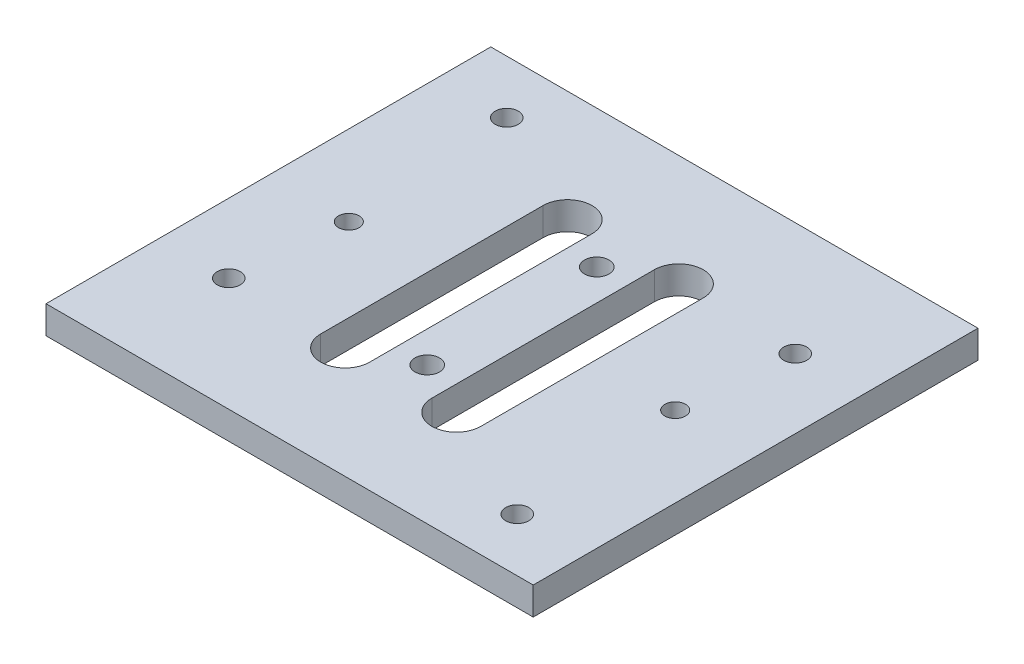
ISO-10303-21;
HEADER;
FILE_DESCRIPTION(('STEP AP214'),'2;1');
FILE_NAME('part.step','',(''),(''),'','','');
FILE_SCHEMA(('AUTOMOTIVE_DESIGN { 1 0 10303 214 1 1 1 1 }'));
ENDSEC;
DATA;
#1=APPLICATION_CONTEXT('core data for automotive mechanical design processes');
#2=APPLICATION_PROTOCOL_DEFINITION('international standard','automotive_design',2000,#1);
#3=PRODUCT_CONTEXT('',#1,'mechanical');
#4=PRODUCT('Part','Part','',(#3));
#5=PRODUCT_RELATED_PRODUCT_CATEGORY('part','',(#4));
#6=PRODUCT_DEFINITION_FORMATION('','',#4);
#7=PRODUCT_DEFINITION_CONTEXT('part definition',#1,'design');
#8=PRODUCT_DEFINITION('design','',#6,#7);
#9=PRODUCT_DEFINITION_SHAPE('','',#8);
#10=(LENGTH_UNIT() NAMED_UNIT(*) SI_UNIT(.MILLI.,.METRE.));
#11=(NAMED_UNIT(*) PLANE_ANGLE_UNIT() SI_UNIT($,.RADIAN.));
#12=(NAMED_UNIT(*) SI_UNIT($,.STERADIAN.) SOLID_ANGLE_UNIT());
#13=UNCERTAINTY_MEASURE_WITH_UNIT(LENGTH_MEASURE(1.E-05),#10,'distance_accuracy_value','');
#14=(GEOMETRIC_REPRESENTATION_CONTEXT(3) GLOBAL_UNCERTAINTY_ASSIGNED_CONTEXT((#13)) GLOBAL_UNIT_ASSIGNED_CONTEXT((#10,
#11,#12)) REPRESENTATION_CONTEXT('',''));
#15=CARTESIAN_POINT('',(0.,0.,0.));
#16=DIRECTION('',(0.,0.,1.));
#17=DIRECTION('',(1.,0.,0.));
#18=AXIS2_PLACEMENT_3D('',#15,#16,#17);
#19=CARTESIAN_POINT('',(0.,5.,0.));
#20=DIRECTION('',(1.,0.,0.));
#21=DIRECTION('',(0.,0.,-1.));
#22=AXIS2_PLACEMENT_3D('',#19,#20,#21);
#23=PLANE('',#22);
#24=DIRECTION('',(0.,0.,1.));
#25=VECTOR('',#24,1.);
#26=CARTESIAN_POINT('',(0.,0.,0.));
#27=LINE('',#26,#25);
#28=CARTESIAN_POINT('',(0.,0.,-80.));
#29=VERTEX_POINT('',#28);
#30=CARTESIAN_POINT('',(0.,0.,0.));
#31=VERTEX_POINT('',#30);
#32=EDGE_CURVE('E233',#29,#31,#27,.T.);
#33=ORIENTED_EDGE('',*,*,#32,.T.);
#34=DIRECTION('',(0.,-1.,0.));
#35=VECTOR('',#34,1.);
#36=CARTESIAN_POINT('',(0.,5.,0.));
#37=LINE('',#36,#35);
#38=CARTESIAN_POINT('',(0.,5.,0.));
#39=VERTEX_POINT('',#38);
#40=EDGE_CURVE('E11',#39,#31,#37,.T.);
#41=ORIENTED_EDGE('',*,*,#40,.F.);
#42=DIRECTION('',(0.,0.,1.));
#43=VECTOR('',#42,1.);
#44=CARTESIAN_POINT('',(0.,5.,0.));
#45=LINE('',#44,#43);
#46=CARTESIAN_POINT('',(0.,5.,-80.));
#47=VERTEX_POINT('',#46);
#48=EDGE_CURVE('E236',#47,#39,#45,.T.);
#49=ORIENTED_EDGE('',*,*,#48,.F.);
#50=DIRECTION('',(0.,-1.,0.));
#51=VECTOR('',#50,1.);
#52=CARTESIAN_POINT('',(0.,5.,-80.));
#53=LINE('',#52,#51);
#54=EDGE_CURVE('E246',#47,#29,#53,.T.);
#55=ORIENTED_EDGE('',*,*,#54,.T.);
#56=EDGE_LOOP('',(#33,#41,#49,#55));
#57=FACE_BOUND('',#56,.T.);
#58=ADVANCED_FACE('F33',(#57),#23,.F.);
#59=CARTESIAN_POINT('',(0.,5.,0.));
#60=DIRECTION('',(0.,0.,-1.));
#61=DIRECTION('',(-1.,0.,0.));
#62=AXIS2_PLACEMENT_3D('',#59,#60,#61);
#63=PLANE('',#62);
#64=DIRECTION('',(1.,0.,0.));
#65=VECTOR('',#64,1.);
#66=CARTESIAN_POINT('',(0.,0.,0.));
#67=LINE('',#66,#65);
#68=CARTESIAN_POINT('',(87.63,0.,0.));
#69=VERTEX_POINT('',#68);
#70=EDGE_CURVE('E249',#31,#69,#67,.T.);
#71=ORIENTED_EDGE('',*,*,#70,.T.);
#72=DIRECTION('',(0.,-1.,0.));
#73=VECTOR('',#72,1.);
#74=CARTESIAN_POINT('',(87.63,5.,0.));
#75=LINE('',#74,#73);
#76=CARTESIAN_POINT('',(87.63,5.,0.));
#77=VERTEX_POINT('',#76);
#78=EDGE_CURVE('E40',#77,#69,#75,.T.);
#79=ORIENTED_EDGE('',*,*,#78,.F.);
#80=DIRECTION('',(1.,0.,0.));
#81=VECTOR('',#80,1.);
#82=CARTESIAN_POINT('',(0.,5.,0.));
#83=LINE('',#82,#81);
#84=EDGE_CURVE('E239',#39,#77,#83,.T.);
#85=ORIENTED_EDGE('',*,*,#84,.F.);
#86=ORIENTED_EDGE('',*,*,#40,.T.);
#87=EDGE_LOOP('',(#71,#79,#85,#86));
#88=FACE_BOUND('',#87,.T.);
#89=ADVANCED_FACE('F278',(#88),#63,.F.);
#90=CARTESIAN_POINT('',(87.63,5.,0.));
#91=DIRECTION('',(-1.,0.,0.));
#92=DIRECTION('',(0.,0.,1.));
#93=AXIS2_PLACEMENT_3D('',#90,#91,#92);
#94=PLANE('',#93);
#95=DIRECTION('',(0.,0.,-1.));
#96=VECTOR('',#95,1.);
#97=CARTESIAN_POINT('',(87.63,0.,0.));
#98=LINE('',#97,#96);
#99=CARTESIAN_POINT('',(87.63,0.,-80.));
#100=VERTEX_POINT('',#99);
#101=EDGE_CURVE('E251',#69,#100,#98,.T.);
#102=ORIENTED_EDGE('',*,*,#101,.T.);
#103=DIRECTION('',(0.,-1.,0.));
#104=VECTOR('',#103,1.);
#105=CARTESIAN_POINT('',(87.63,5.,-80.));
#106=LINE('',#105,#104);
#107=CARTESIAN_POINT('',(87.63,5.,-80.));
#108=VERTEX_POINT('',#107);
#109=EDGE_CURVE('E256',#108,#100,#106,.T.);
#110=ORIENTED_EDGE('',*,*,#109,.F.);
#111=DIRECTION('',(0.,0.,-1.));
#112=VECTOR('',#111,1.);
#113=CARTESIAN_POINT('',(87.63,5.,0.));
#114=LINE('',#113,#112);
#115=EDGE_CURVE('E242',#77,#108,#114,.T.);
#116=ORIENTED_EDGE('',*,*,#115,.F.);
#117=ORIENTED_EDGE('',*,*,#78,.T.);
#118=EDGE_LOOP('',(#102,#110,#116,#117));
#119=FACE_BOUND('',#118,.T.);
#120=ADVANCED_FACE('F263',(#119),#94,.F.);
#121=CARTESIAN_POINT('',(0.,5.,-80.));
#122=DIRECTION('',(0.,0.,1.));
#123=DIRECTION('',(1.,0.,0.));
#124=AXIS2_PLACEMENT_3D('',#121,#122,#123);
#125=PLANE('',#124);
#126=DIRECTION('',(-1.,0.,0.));
#127=VECTOR('',#126,1.);
#128=CARTESIAN_POINT('',(0.,0.,-80.));
#129=LINE('',#128,#127);
#130=EDGE_CURVE('E240',#100,#29,#129,.T.);
#131=ORIENTED_EDGE('',*,*,#130,.T.);
#132=ORIENTED_EDGE('',*,*,#54,.F.);
#133=DIRECTION('',(-1.,0.,0.));
#134=VECTOR('',#133,1.);
#135=CARTESIAN_POINT('',(0.,5.,-80.));
#136=LINE('',#135,#134);
#137=EDGE_CURVE('E244',#108,#47,#136,.T.);
#138=ORIENTED_EDGE('',*,*,#137,.F.);
#139=ORIENTED_EDGE('',*,*,#109,.T.);
#140=EDGE_LOOP('',(#131,#132,#138,#139));
#141=FACE_BOUND('',#140,.T.);
#142=ADVANCED_FACE('F271',(#141),#125,.F.);
#143=CARTESIAN_POINT('',(0.,5.,0.));
#144=DIRECTION('',(0.,-1.,0.));
#145=DIRECTION('',(0.,0.,-1.));
#146=AXIS2_PLACEMENT_3D('',#143,#144,#145);
#147=PLANE('',#146);
#148=DIRECTION('',(0.,0.,1.));
#149=VECTOR('',#148,1.);
#150=CARTESIAN_POINT('',(49.41,5.,-60.));
#151=LINE('',#150,#149);
#152=CARTESIAN_POINT('',(49.41,5.,-60.));
#153=VERTEX_POINT('',#152);
#154=CARTESIAN_POINT('',(49.41,5.,-20.));
#155=VERTEX_POINT('',#154);
#156=EDGE_CURVE('E140',#153,#155,#151,.T.);
#157=ORIENTED_EDGE('',*,*,#156,.F.);
#158=CARTESIAN_POINT('',(53.81,5.,-60.));
#159=DIRECTION('',(0.,1.,0.));
#160=DIRECTION('',(0.,0.,1.));
#161=AXIS2_PLACEMENT_3D('',#158,#159,#160);
#162=CIRCLE('',#161,4.40000000000001);
#163=CARTESIAN_POINT('',(58.21,5.,-60.));
#164=VERTEX_POINT('',#163);
#165=EDGE_CURVE('E47',#164,#153,#162,.T.);
#166=ORIENTED_EDGE('',*,*,#165,.F.);
#167=DIRECTION('',(0.,0.,-1.));
#168=VECTOR('',#167,1.);
#169=CARTESIAN_POINT('',(58.21,5.,-60.));
#170=LINE('',#169,#168);
#171=CARTESIAN_POINT('',(58.21,5.,-20.));
#172=VERTEX_POINT('',#171);
#173=EDGE_CURVE('E133',#172,#164,#170,.T.);
#174=ORIENTED_EDGE('',*,*,#173,.F.);
#175=CARTESIAN_POINT('',(53.81,5.,-20.));
#176=DIRECTION('',(0.,1.,0.));
#177=DIRECTION('',(0.,0.,1.));
#178=AXIS2_PLACEMENT_3D('',#175,#176,#177);
#179=CIRCLE('',#178,4.40000000000001);
#180=EDGE_CURVE('E147',#155,#172,#179,.T.);
#181=ORIENTED_EDGE('',*,*,#180,.F.);
#182=EDGE_LOOP('',(#157,#166,#174,#181));
#183=FACE_BOUND('',#182,.T.);
#184=DIRECTION('',(0.,0.,1.));
#185=VECTOR('',#184,1.);
#186=CARTESIAN_POINT('',(29.41,5.,-60.));
#187=LINE('',#186,#185);
#188=CARTESIAN_POINT('',(29.41,5.,-60.));
#189=VERTEX_POINT('',#188);
#190=CARTESIAN_POINT('',(29.41,5.,-20.));
#191=VERTEX_POINT('',#190);
#192=EDGE_CURVE('E166',#189,#191,#187,.T.);
#193=ORIENTED_EDGE('',*,*,#192,.F.);
#194=CARTESIAN_POINT('',(33.81,5.,-60.));
#195=DIRECTION('',(0.,1.,0.));
#196=DIRECTION('',(0.,0.,1.));
#197=AXIS2_PLACEMENT_3D('',#194,#195,#196);
#198=CIRCLE('',#197,4.4);
#199=CARTESIAN_POINT('',(38.21,5.,-60.));
#200=VERTEX_POINT('',#199);
#201=EDGE_CURVE('E164',#200,#189,#198,.T.);
#202=ORIENTED_EDGE('',*,*,#201,.F.);
#203=DIRECTION('',(0.,0.,-1.));
#204=VECTOR('',#203,1.);
#205=CARTESIAN_POINT('',(38.21,5.,-60.));
#206=LINE('',#205,#204);
#207=CARTESIAN_POINT('',(38.21,5.,-20.));
#208=VERTEX_POINT('',#207);
#209=EDGE_CURVE('E172',#208,#200,#206,.T.);
#210=ORIENTED_EDGE('',*,*,#209,.F.);
#211=CARTESIAN_POINT('',(33.81,5.,-20.));
#212=DIRECTION('',(0.,1.,0.));
#213=DIRECTION('',(0.,0.,1.));
#214=AXIS2_PLACEMENT_3D('',#211,#212,#213);
#215=CIRCLE('',#214,4.4);
#216=EDGE_CURVE('E169',#191,#208,#215,.T.);
#217=ORIENTED_EDGE('',*,*,#216,.F.);
#218=EDGE_LOOP('',(#193,#202,#210,#217));
#219=FACE_BOUND('',#218,.T.);
#220=CARTESIAN_POINT('',(43.82,5.,-24.75));
#221=DIRECTION('',(0.,1.,0.));
#222=DIRECTION('',(0.,0.,1.));
#223=AXIS2_PLACEMENT_3D('',#220,#221,#222);
#224=CIRCLE('',#223,2.2);
#225=CARTESIAN_POINT('',(43.82,5.,-22.55));
#226=VERTEX_POINT('',#225);
#227=EDGE_CURVE('E188',#226,#226,#224,.T.);
#228=ORIENTED_EDGE('',*,*,#227,.F.);
#229=EDGE_LOOP('',(#228));
#230=FACE_BOUND('',#229,.T.);
#231=CARTESIAN_POINT('',(43.81,5.,-55.25));
#232=DIRECTION('',(0.,1.,0.));
#233=DIRECTION('',(0.,0.,1.));
#234=AXIS2_PLACEMENT_3D('',#231,#232,#233);
#235=CIRCLE('',#234,2.20000000000001);
#236=CARTESIAN_POINT('',(43.81,5.,-53.05));
#237=VERTEX_POINT('',#236);
#238=EDGE_CURVE('E194',#237,#237,#235,.T.);
#239=ORIENTED_EDGE('',*,*,#238,.F.);
#240=EDGE_LOOP('',(#239));
#241=FACE_BOUND('',#240,.T.);
#242=CARTESIAN_POINT('',(75.165,5.,-59.6));
#243=DIRECTION('',(0.,1.,0.));
#244=DIRECTION('',(0.,0.,1.));
#245=AXIS2_PLACEMENT_3D('',#242,#243,#244);
#246=CIRCLE('',#245,2.07499999999999);
#247=CARTESIAN_POINT('',(75.165,5.,-57.525));
#248=VERTEX_POINT('',#247);
#249=EDGE_CURVE('E197',#248,#248,#246,.T.);
#250=ORIENTED_EDGE('',*,*,#249,.F.);
#251=EDGE_LOOP('',(#250));
#252=FACE_BOUND('',#251,.T.);
#253=CARTESIAN_POINT('',(75.165,5.,-9.60000000000001));
#254=DIRECTION('',(0.,1.,0.));
#255=DIRECTION('',(0.,0.,1.));
#256=AXIS2_PLACEMENT_3D('',#253,#254,#255);
#257=CIRCLE('',#256,2.07499999999999);
#258=CARTESIAN_POINT('',(75.165,5.,-7.52500000000002));
#259=VERTEX_POINT('',#258);
#260=EDGE_CURVE('E203',#259,#259,#257,.T.);
#261=ORIENTED_EDGE('',*,*,#260,.F.);
#262=EDGE_LOOP('',(#261));
#263=FACE_BOUND('',#262,.T.);
#264=CARTESIAN_POINT('',(73.165,5.,-40.));
#265=DIRECTION('',(0.,1.,0.));
#266=DIRECTION('',(0.,0.,1.));
#267=AXIS2_PLACEMENT_3D('',#264,#265,#266);
#268=CIRCLE('',#267,1.84999999999999);
#269=CARTESIAN_POINT('',(73.165,5.,-38.15));
#270=VERTEX_POINT('',#269);
#271=EDGE_CURVE('E209',#270,#270,#268,.T.);
#272=ORIENTED_EDGE('',*,*,#271,.F.);
#273=EDGE_LOOP('',(#272));
#274=FACE_BOUND('',#273,.T.);
#275=CARTESIAN_POINT('',(14.465,5.,-40.));
#276=DIRECTION('',(0.,1.,0.));
#277=DIRECTION('',(0.,0.,1.));
#278=AXIS2_PLACEMENT_3D('',#275,#276,#277);
#279=CIRCLE('',#278,1.85);
#280=CARTESIAN_POINT('',(14.465,5.,-38.15));
#281=VERTEX_POINT('',#280);
#282=EDGE_CURVE('E215',#281,#281,#279,.T.);
#283=ORIENTED_EDGE('',*,*,#282,.F.);
#284=EDGE_LOOP('',(#283));
#285=FACE_BOUND('',#284,.T.);
#286=CARTESIAN_POINT('',(12.465,5.,-20.4));
#287=DIRECTION('',(0.,1.,0.));
#288=DIRECTION('',(0.,0.,1.));
#289=AXIS2_PLACEMENT_3D('',#286,#287,#288);
#290=CIRCLE('',#289,2.075);
#291=CARTESIAN_POINT('',(12.465,5.,-18.325));
#292=VERTEX_POINT('',#291);
#293=EDGE_CURVE('E221',#292,#292,#290,.T.);
#294=ORIENTED_EDGE('',*,*,#293,.F.);
#295=EDGE_LOOP('',(#294));
#296=FACE_BOUND('',#295,.T.);
#297=CARTESIAN_POINT('',(12.465,5.,-70.4));
#298=DIRECTION('',(0.,1.,0.));
#299=DIRECTION('',(0.,0.,1.));
#300=AXIS2_PLACEMENT_3D('',#297,#298,#299);
#301=CIRCLE('',#300,2.07499999999999);
#302=CARTESIAN_POINT('',(12.465,5.,-68.325));
#303=VERTEX_POINT('',#302);
#304=EDGE_CURVE('E227',#303,#303,#301,.T.);
#305=ORIENTED_EDGE('',*,*,#304,.F.);
#306=EDGE_LOOP('',(#305));
#307=FACE_BOUND('',#306,.T.);
#308=ORIENTED_EDGE('',*,*,#48,.T.);
#309=ORIENTED_EDGE('',*,*,#84,.T.);
#310=ORIENTED_EDGE('',*,*,#115,.T.);
#311=ORIENTED_EDGE('',*,*,#137,.T.);
#312=EDGE_LOOP('',(#308,#309,#310,#311));
#313=FACE_BOUND('',#312,.T.);
#314=ADVANCED_FACE('F277',(#183,#219,#230,#241,#252,#263,#274,#285,#296,#307,#313),#147,.F.);
#315=CARTESIAN_POINT('',(0.,0.,0.));
#316=DIRECTION('',(0.,-1.,0.));
#317=DIRECTION('',(0.,0.,-1.));
#318=AXIS2_PLACEMENT_3D('',#315,#316,#317);
#319=PLANE('',#318);
#320=CARTESIAN_POINT('',(53.81,0.,-60.));
#321=DIRECTION('',(0.,-1.,0.));
#322=DIRECTION('',(0.,0.,-1.));
#323=AXIS2_PLACEMENT_3D('',#320,#321,#322);
#324=CIRCLE('',#323,4.40000000000001);
#325=CARTESIAN_POINT('',(58.21,0.,-60.));
#326=VERTEX_POINT('',#325);
#327=CARTESIAN_POINT('',(49.41,0.,-60.));
#328=VERTEX_POINT('',#327);
#329=EDGE_CURVE('E131',#326,#328,#324,.F.);
#330=ORIENTED_EDGE('',*,*,#329,.T.);
#331=DIRECTION('',(0.,0.,1.));
#332=VECTOR('',#331,1.);
#333=CARTESIAN_POINT('',(49.41,0.,-60.));
#334=LINE('',#333,#332);
#335=CARTESIAN_POINT('',(49.41,0.,-20.));
#336=VERTEX_POINT('',#335);
#337=EDGE_CURVE('E120',#328,#336,#334,.T.);
#338=ORIENTED_EDGE('',*,*,#337,.T.);
#339=CARTESIAN_POINT('',(53.81,0.,-20.));
#340=DIRECTION('',(0.,-1.,0.));
#341=DIRECTION('',(0.,0.,-1.));
#342=AXIS2_PLACEMENT_3D('',#339,#340,#341);
#343=CIRCLE('',#342,4.40000000000001);
#344=CARTESIAN_POINT('',(58.21,0.,-20.));
#345=VERTEX_POINT('',#344);
#346=EDGE_CURVE('E142',#336,#345,#343,.F.);
#347=ORIENTED_EDGE('',*,*,#346,.T.);
#348=DIRECTION('',(0.,0.,-1.));
#349=VECTOR('',#348,1.);
#350=CARTESIAN_POINT('',(58.21,0.,-60.));
#351=LINE('',#350,#349);
#352=EDGE_CURVE('E138',#345,#326,#351,.T.);
#353=ORIENTED_EDGE('',*,*,#352,.T.);
#354=EDGE_LOOP('',(#330,#338,#347,#353));
#355=FACE_BOUND('',#354,.T.);
#356=CARTESIAN_POINT('',(33.81,0.,-60.));
#357=DIRECTION('',(0.,-1.,0.));
#358=DIRECTION('',(0.,0.,-1.));
#359=AXIS2_PLACEMENT_3D('',#356,#357,#358);
#360=CIRCLE('',#359,4.4);
#361=CARTESIAN_POINT('',(38.21,0.,-60.));
#362=VERTEX_POINT('',#361);
#363=CARTESIAN_POINT('',(29.41,0.,-60.));
#364=VERTEX_POINT('',#363);
#365=EDGE_CURVE('E161',#362,#364,#360,.F.);
#366=ORIENTED_EDGE('',*,*,#365,.T.);
#367=DIRECTION('',(0.,0.,1.));
#368=VECTOR('',#367,1.);
#369=CARTESIAN_POINT('',(29.41,0.,-60.));
#370=LINE('',#369,#368);
#371=CARTESIAN_POINT('',(29.41,0.,-20.));
#372=VERTEX_POINT('',#371);
#373=EDGE_CURVE('E178',#364,#372,#370,.T.);
#374=ORIENTED_EDGE('',*,*,#373,.T.);
#375=CARTESIAN_POINT('',(33.81,0.,-20.));
#376=DIRECTION('',(0.,-1.,0.));
#377=DIRECTION('',(0.,0.,-1.));
#378=AXIS2_PLACEMENT_3D('',#375,#376,#377);
#379=CIRCLE('',#378,4.4);
#380=CARTESIAN_POINT('',(38.21,0.,-20.));
#381=VERTEX_POINT('',#380);
#382=EDGE_CURVE('E127',#372,#381,#379,.F.);
#383=ORIENTED_EDGE('',*,*,#382,.T.);
#384=DIRECTION('',(0.,0.,-1.));
#385=VECTOR('',#384,1.);
#386=CARTESIAN_POINT('',(38.21,0.,-60.));
#387=LINE('',#386,#385);
#388=EDGE_CURVE('E158',#381,#362,#387,.T.);
#389=ORIENTED_EDGE('',*,*,#388,.T.);
#390=EDGE_LOOP('',(#366,#374,#383,#389));
#391=FACE_BOUND('',#390,.T.);
#392=CARTESIAN_POINT('',(43.82,0.,-24.75));
#393=DIRECTION('',(0.,-1.,0.));
#394=DIRECTION('',(0.,0.,-1.));
#395=AXIS2_PLACEMENT_3D('',#392,#393,#394);
#396=CIRCLE('',#395,2.2);
#397=CARTESIAN_POINT('',(43.82,0.,-26.95));
#398=VERTEX_POINT('',#397);
#399=EDGE_CURVE('E187',#398,#398,#396,.F.);
#400=ORIENTED_EDGE('',*,*,#399,.T.);
#401=EDGE_LOOP('',(#400));
#402=FACE_BOUND('',#401,.T.);
#403=CARTESIAN_POINT('',(43.81,0.,-55.25));
#404=DIRECTION('',(0.,-1.,0.));
#405=DIRECTION('',(0.,0.,-1.));
#406=AXIS2_PLACEMENT_3D('',#403,#404,#405);
#407=CIRCLE('',#406,2.20000000000001);
#408=CARTESIAN_POINT('',(43.81,0.,-57.45));
#409=VERTEX_POINT('',#408);
#410=EDGE_CURVE('E191',#409,#409,#407,.F.);
#411=ORIENTED_EDGE('',*,*,#410,.T.);
#412=EDGE_LOOP('',(#411));
#413=FACE_BOUND('',#412,.T.);
#414=CARTESIAN_POINT('',(75.165,0.,-59.6));
#415=DIRECTION('',(0.,1.,0.));
#416=DIRECTION('',(0.,0.,1.));
#417=AXIS2_PLACEMENT_3D('',#414,#415,#416);
#418=CIRCLE('',#417,2.07499999999999);
#419=CARTESIAN_POINT('',(75.165,0.,-57.525));
#420=VERTEX_POINT('',#419);
#421=EDGE_CURVE('E200',#420,#420,#418,.T.);
#422=ORIENTED_EDGE('',*,*,#421,.T.);
#423=EDGE_LOOP('',(#422));
#424=FACE_BOUND('',#423,.T.);
#425=CARTESIAN_POINT('',(75.165,0.,-9.60000000000001));
#426=DIRECTION('',(0.,1.,0.));
#427=DIRECTION('',(0.,0.,1.));
#428=AXIS2_PLACEMENT_3D('',#425,#426,#427);
#429=CIRCLE('',#428,2.07499999999999);
#430=CARTESIAN_POINT('',(75.165,0.,-7.52500000000002));
#431=VERTEX_POINT('',#430);
#432=EDGE_CURVE('E206',#431,#431,#429,.T.);
#433=ORIENTED_EDGE('',*,*,#432,.T.);
#434=EDGE_LOOP('',(#433));
#435=FACE_BOUND('',#434,.T.);
#436=CARTESIAN_POINT('',(73.165,0.,-40.));
#437=DIRECTION('',(0.,1.,0.));
#438=DIRECTION('',(0.,0.,1.));
#439=AXIS2_PLACEMENT_3D('',#436,#437,#438);
#440=CIRCLE('',#439,1.84999999999999);
#441=CARTESIAN_POINT('',(73.165,0.,-38.15));
#442=VERTEX_POINT('',#441);
#443=EDGE_CURVE('E212',#442,#442,#440,.T.);
#444=ORIENTED_EDGE('',*,*,#443,.T.);
#445=EDGE_LOOP('',(#444));
#446=FACE_BOUND('',#445,.T.);
#447=CARTESIAN_POINT('',(14.465,0.,-40.));
#448=DIRECTION('',(0.,1.,0.));
#449=DIRECTION('',(0.,0.,1.));
#450=AXIS2_PLACEMENT_3D('',#447,#448,#449);
#451=CIRCLE('',#450,1.85);
#452=CARTESIAN_POINT('',(14.465,0.,-38.15));
#453=VERTEX_POINT('',#452);
#454=EDGE_CURVE('E218',#453,#453,#451,.T.);
#455=ORIENTED_EDGE('',*,*,#454,.T.);
#456=EDGE_LOOP('',(#455));
#457=FACE_BOUND('',#456,.T.);
#458=CARTESIAN_POINT('',(12.465,0.,-20.4));
#459=DIRECTION('',(0.,1.,0.));
#460=DIRECTION('',(0.,0.,1.));
#461=AXIS2_PLACEMENT_3D('',#458,#459,#460);
#462=CIRCLE('',#461,2.075);
#463=CARTESIAN_POINT('',(12.465,0.,-18.325));
#464=VERTEX_POINT('',#463);
#465=EDGE_CURVE('E224',#464,#464,#462,.T.);
#466=ORIENTED_EDGE('',*,*,#465,.T.);
#467=EDGE_LOOP('',(#466));
#468=FACE_BOUND('',#467,.T.);
#469=CARTESIAN_POINT('',(12.465,0.,-70.4));
#470=DIRECTION('',(0.,1.,0.));
#471=DIRECTION('',(0.,0.,1.));
#472=AXIS2_PLACEMENT_3D('',#469,#470,#471);
#473=CIRCLE('',#472,2.07499999999999);
#474=CARTESIAN_POINT('',(12.465,0.,-68.325));
#475=VERTEX_POINT('',#474);
#476=EDGE_CURVE('E230',#475,#475,#473,.T.);
#477=ORIENTED_EDGE('',*,*,#476,.T.);
#478=EDGE_LOOP('',(#477));
#479=FACE_BOUND('',#478,.T.);
#480=ORIENTED_EDGE('',*,*,#32,.F.);
#481=ORIENTED_EDGE('',*,*,#130,.F.);
#482=ORIENTED_EDGE('',*,*,#101,.F.);
#483=ORIENTED_EDGE('',*,*,#70,.F.);
#484=EDGE_LOOP('',(#480,#481,#482,#483));
#485=FACE_BOUND('',#484,.T.);
#486=ADVANCED_FACE('F136',(#355,#391,#402,#413,#424,#435,#446,#457,#468,#479,#485),#319,.T.);
#487=CARTESIAN_POINT('',(12.465,0.,-70.4));
#488=DIRECTION('',(0.,1.,0.));
#489=DIRECTION('',(0.,0.,1.));
#490=AXIS2_PLACEMENT_3D('',#487,#488,#489);
#491=CYLINDRICAL_SURFACE('',#490,2.07499999999999);
#492=ORIENTED_EDGE('',*,*,#476,.F.);
#493=EDGE_LOOP('',(#492));
#494=FACE_BOUND('',#493,.T.);
#495=ORIENTED_EDGE('',*,*,#304,.T.);
#496=EDGE_LOOP('',(#495));
#497=FACE_BOUND('',#496,.T.);
#498=ADVANCED_FACE('F290',(#494,#497),#491,.F.);
#499=CARTESIAN_POINT('',(12.465,0.,-20.4));
#500=DIRECTION('',(0.,1.,0.));
#501=DIRECTION('',(0.,0.,1.));
#502=AXIS2_PLACEMENT_3D('',#499,#500,#501);
#503=CYLINDRICAL_SURFACE('',#502,2.075);
#504=ORIENTED_EDGE('',*,*,#465,.F.);
#505=EDGE_LOOP('',(#504));
#506=FACE_BOUND('',#505,.T.);
#507=ORIENTED_EDGE('',*,*,#293,.T.);
#508=EDGE_LOOP('',(#507));
#509=FACE_BOUND('',#508,.T.);
#510=ADVANCED_FACE('F296',(#506,#509),#503,.F.);
#511=CARTESIAN_POINT('',(14.465,0.,-40.));
#512=DIRECTION('',(0.,1.,0.));
#513=DIRECTION('',(0.,0.,1.));
#514=AXIS2_PLACEMENT_3D('',#511,#512,#513);
#515=CYLINDRICAL_SURFACE('',#514,1.85);
#516=ORIENTED_EDGE('',*,*,#454,.F.);
#517=EDGE_LOOP('',(#516));
#518=FACE_BOUND('',#517,.T.);
#519=ORIENTED_EDGE('',*,*,#282,.T.);
#520=EDGE_LOOP('',(#519));
#521=FACE_BOUND('',#520,.T.);
#522=ADVANCED_FACE('F300',(#518,#521),#515,.F.);
#523=CARTESIAN_POINT('',(73.165,0.,-40.));
#524=DIRECTION('',(0.,1.,0.));
#525=DIRECTION('',(0.,0.,1.));
#526=AXIS2_PLACEMENT_3D('',#523,#524,#525);
#527=CYLINDRICAL_SURFACE('',#526,1.84999999999999);
#528=ORIENTED_EDGE('',*,*,#443,.F.);
#529=EDGE_LOOP('',(#528));
#530=FACE_BOUND('',#529,.T.);
#531=ORIENTED_EDGE('',*,*,#271,.T.);
#532=EDGE_LOOP('',(#531));
#533=FACE_BOUND('',#532,.T.);
#534=ADVANCED_FACE('F304',(#530,#533),#527,.F.);
#535=CARTESIAN_POINT('',(75.165,0.,-9.60000000000001));
#536=DIRECTION('',(0.,1.,0.));
#537=DIRECTION('',(0.,0.,1.));
#538=AXIS2_PLACEMENT_3D('',#535,#536,#537);
#539=CYLINDRICAL_SURFACE('',#538,2.07499999999999);
#540=ORIENTED_EDGE('',*,*,#432,.F.);
#541=EDGE_LOOP('',(#540));
#542=FACE_BOUND('',#541,.T.);
#543=ORIENTED_EDGE('',*,*,#260,.T.);
#544=EDGE_LOOP('',(#543));
#545=FACE_BOUND('',#544,.T.);
#546=ADVANCED_FACE('F308',(#542,#545),#539,.F.);
#547=CARTESIAN_POINT('',(75.165,0.,-59.6));
#548=DIRECTION('',(0.,1.,0.));
#549=DIRECTION('',(0.,0.,1.));
#550=AXIS2_PLACEMENT_3D('',#547,#548,#549);
#551=CYLINDRICAL_SURFACE('',#550,2.07499999999999);
#552=ORIENTED_EDGE('',*,*,#421,.F.);
#553=EDGE_LOOP('',(#552));
#554=FACE_BOUND('',#553,.T.);
#555=ORIENTED_EDGE('',*,*,#249,.T.);
#556=EDGE_LOOP('',(#555));
#557=FACE_BOUND('',#556,.T.);
#558=ADVANCED_FACE('F312',(#554,#557),#551,.F.);
#559=CARTESIAN_POINT('',(43.81,-0.00100000000000013,-55.25));
#560=DIRECTION('',(0.,1.,0.));
#561=DIRECTION('',(0.,0.,1.));
#562=AXIS2_PLACEMENT_3D('',#559,#560,#561);
#563=CYLINDRICAL_SURFACE('',#562,2.20000000000001);
#564=ORIENTED_EDGE('',*,*,#410,.F.);
#565=EDGE_LOOP('',(#564));
#566=FACE_BOUND('',#565,.T.);
#567=ORIENTED_EDGE('',*,*,#238,.T.);
#568=EDGE_LOOP('',(#567));
#569=FACE_BOUND('',#568,.T.);
#570=ADVANCED_FACE('F316',(#566,#569),#563,.F.);
#571=CARTESIAN_POINT('',(43.82,-0.00100000000000013,-24.75));
#572=DIRECTION('',(0.,1.,0.));
#573=DIRECTION('',(0.,0.,1.));
#574=AXIS2_PLACEMENT_3D('',#571,#572,#573);
#575=CYLINDRICAL_SURFACE('',#574,2.2);
#576=ORIENTED_EDGE('',*,*,#399,.F.);
#577=EDGE_LOOP('',(#576));
#578=FACE_BOUND('',#577,.T.);
#579=ORIENTED_EDGE('',*,*,#227,.T.);
#580=EDGE_LOOP('',(#579));
#581=FACE_BOUND('',#580,.T.);
#582=ADVANCED_FACE('F320',(#578,#581),#575,.F.);
#583=CARTESIAN_POINT('',(33.81,-0.00100000000000013,-60.));
#584=DIRECTION('',(0.,1.,0.));
#585=DIRECTION('',(0.,0.,1.));
#586=AXIS2_PLACEMENT_3D('',#583,#584,#585);
#587=CYLINDRICAL_SURFACE('',#586,4.4);
#588=DIRECTION('',(0.,1.,0.));
#589=VECTOR('',#588,1.);
#590=CARTESIAN_POINT('',(38.21,-0.00100000000000013,-60.));
#591=LINE('',#590,#589);
#592=EDGE_CURVE('E176',#362,#200,#591,.T.);
#593=ORIENTED_EDGE('',*,*,#592,.T.);
#594=ORIENTED_EDGE('',*,*,#201,.T.);
#595=DIRECTION('',(0.,1.,0.));
#596=VECTOR('',#595,1.);
#597=CARTESIAN_POINT('',(29.41,-0.00100000000000013,-60.));
#598=LINE('',#597,#596);
#599=EDGE_CURVE('E175',#364,#189,#598,.T.);
#600=ORIENTED_EDGE('',*,*,#599,.F.);
#601=ORIENTED_EDGE('',*,*,#365,.F.);
#602=EDGE_LOOP('',(#593,#594,#600,#601));
#603=FACE_BOUND('',#602,.T.);
#604=ADVANCED_FACE('F324',(#603),#587,.F.);
#605=CARTESIAN_POINT('',(38.21,-0.00100000000000013,-60.));
#606=DIRECTION('',(1.,0.,0.));
#607=DIRECTION('',(0.,0.,-1.));
#608=AXIS2_PLACEMENT_3D('',#605,#606,#607);
#609=PLANE('',#608);
#610=DIRECTION('',(0.,1.,0.));
#611=VECTOR('',#610,1.);
#612=CARTESIAN_POINT('',(38.21,-0.00100000000000013,-20.));
#613=LINE('',#612,#611);
#614=EDGE_CURVE('E179',#381,#208,#613,.T.);
#615=ORIENTED_EDGE('',*,*,#614,.T.);
#616=ORIENTED_EDGE('',*,*,#209,.T.);
#617=ORIENTED_EDGE('',*,*,#592,.F.);
#618=ORIENTED_EDGE('',*,*,#388,.F.);
#619=EDGE_LOOP('',(#615,#616,#617,#618));
#620=FACE_BOUND('',#619,.T.);
#621=ADVANCED_FACE('F328',(#620),#609,.F.);
#622=CARTESIAN_POINT('',(33.81,-0.00100000000000013,-20.));
#623=DIRECTION('',(0.,1.,0.));
#624=DIRECTION('',(0.,0.,1.));
#625=AXIS2_PLACEMENT_3D('',#622,#623,#624);
#626=CYLINDRICAL_SURFACE('',#625,4.4);
#627=DIRECTION('',(0.,1.,0.));
#628=VECTOR('',#627,1.);
#629=CARTESIAN_POINT('',(29.41,-0.00100000000000013,-20.));
#630=LINE('',#629,#628);
#631=EDGE_CURVE('E181',#372,#191,#630,.T.);
#632=ORIENTED_EDGE('',*,*,#631,.T.);
#633=ORIENTED_EDGE('',*,*,#216,.T.);
#634=ORIENTED_EDGE('',*,*,#614,.F.);
#635=ORIENTED_EDGE('',*,*,#382,.F.);
#636=EDGE_LOOP('',(#632,#633,#634,#635));
#637=FACE_BOUND('',#636,.T.);
#638=ADVANCED_FACE('F333',(#637),#626,.F.);
#639=CARTESIAN_POINT('',(29.41,-0.00100000000000013,-60.));
#640=DIRECTION('',(-1.,0.,0.));
#641=DIRECTION('',(0.,0.,1.));
#642=AXIS2_PLACEMENT_3D('',#639,#640,#641);
#643=PLANE('',#642);
#644=ORIENTED_EDGE('',*,*,#599,.T.);
#645=ORIENTED_EDGE('',*,*,#192,.T.);
#646=ORIENTED_EDGE('',*,*,#631,.F.);
#647=ORIENTED_EDGE('',*,*,#373,.F.);
#648=EDGE_LOOP('',(#644,#645,#646,#647));
#649=FACE_BOUND('',#648,.T.);
#650=ADVANCED_FACE('F330',(#649),#643,.F.);
#651=CARTESIAN_POINT('',(53.81,-0.00100000000000013,-60.));
#652=DIRECTION('',(0.,1.,0.));
#653=DIRECTION('',(0.,0.,1.));
#654=AXIS2_PLACEMENT_3D('',#651,#652,#653);
#655=CYLINDRICAL_SURFACE('',#654,4.40000000000001);
#656=DIRECTION('',(0.,1.,0.));
#657=VECTOR('',#656,1.);
#658=CARTESIAN_POINT('',(58.21,-0.00100000000000013,-60.));
#659=LINE('',#658,#657);
#660=EDGE_CURVE('E128',#326,#164,#659,.T.);
#661=ORIENTED_EDGE('',*,*,#660,.T.);
#662=ORIENTED_EDGE('',*,*,#165,.T.);
#663=DIRECTION('',(0.,1.,0.));
#664=VECTOR('',#663,1.);
#665=CARTESIAN_POINT('',(49.41,-0.00100000000000013,-60.));
#666=LINE('',#665,#664);
#667=EDGE_CURVE('E122',#328,#153,#666,.T.);
#668=ORIENTED_EDGE('',*,*,#667,.F.);
#669=ORIENTED_EDGE('',*,*,#329,.F.);
#670=EDGE_LOOP('',(#661,#662,#668,#669));
#671=FACE_BOUND('',#670,.T.);
#672=ADVANCED_FACE('F130',(#671),#655,.F.);
#673=CARTESIAN_POINT('',(58.21,-0.00100000000000013,-60.));
#674=DIRECTION('',(1.,0.,0.));
#675=DIRECTION('',(0.,0.,-1.));
#676=AXIS2_PLACEMENT_3D('',#673,#674,#675);
#677=PLANE('',#676);
#678=DIRECTION('',(0.,1.,0.));
#679=VECTOR('',#678,1.);
#680=CARTESIAN_POINT('',(58.21,-0.00100000000000013,-20.));
#681=LINE('',#680,#679);
#682=EDGE_CURVE('E153',#345,#172,#681,.T.);
#683=ORIENTED_EDGE('',*,*,#682,.T.);
#684=ORIENTED_EDGE('',*,*,#173,.T.);
#685=ORIENTED_EDGE('',*,*,#660,.F.);
#686=ORIENTED_EDGE('',*,*,#352,.F.);
#687=EDGE_LOOP('',(#683,#684,#685,#686));
#688=FACE_BOUND('',#687,.T.);
#689=ADVANCED_FACE('F343',(#688),#677,.F.);
#690=CARTESIAN_POINT('',(53.81,-0.00100000000000013,-20.));
#691=DIRECTION('',(0.,1.,0.));
#692=DIRECTION('',(0.,0.,1.));
#693=AXIS2_PLACEMENT_3D('',#690,#691,#692);
#694=CYLINDRICAL_SURFACE('',#693,4.40000000000001);
#695=DIRECTION('',(0.,1.,0.));
#696=VECTOR('',#695,1.);
#697=CARTESIAN_POINT('',(49.41,-0.00100000000000013,-20.));
#698=LINE('',#697,#696);
#699=EDGE_CURVE('E55',#336,#155,#698,.T.);
#700=ORIENTED_EDGE('',*,*,#699,.T.);
#701=ORIENTED_EDGE('',*,*,#180,.T.);
#702=ORIENTED_EDGE('',*,*,#682,.F.);
#703=ORIENTED_EDGE('',*,*,#346,.F.);
#704=EDGE_LOOP('',(#700,#701,#702,#703));
#705=FACE_BOUND('',#704,.T.);
#706=ADVANCED_FACE('F346',(#705),#694,.F.);
#707=CARTESIAN_POINT('',(49.41,-0.00100000000000013,-60.));
#708=DIRECTION('',(-1.,0.,0.));
#709=DIRECTION('',(0.,0.,1.));
#710=AXIS2_PLACEMENT_3D('',#707,#708,#709);
#711=PLANE('',#710);
#712=ORIENTED_EDGE('',*,*,#667,.T.);
#713=ORIENTED_EDGE('',*,*,#156,.T.);
#714=ORIENTED_EDGE('',*,*,#699,.F.);
#715=ORIENTED_EDGE('',*,*,#337,.F.);
#716=EDGE_LOOP('',(#712,#713,#714,#715));
#717=FACE_BOUND('',#716,.T.);
#718=ADVANCED_FACE('F121',(#717),#711,.F.);
#719=CLOSED_SHELL('',(#58,#89,#120,#142,#314,#486,#498,#510,#522,#534,#546,#558,#570,#582,#604,
#621,#638,#650,#672,#689,#706,#718));
#720=MANIFOLD_SOLID_BREP('B2',#719);
#721=ADVANCED_BREP_SHAPE_REPRESENTATION('',(#18,#720),#14);
#722=SHAPE_DEFINITION_REPRESENTATION(#9,#721);
ENDSEC;
END-ISO-10303-21;
